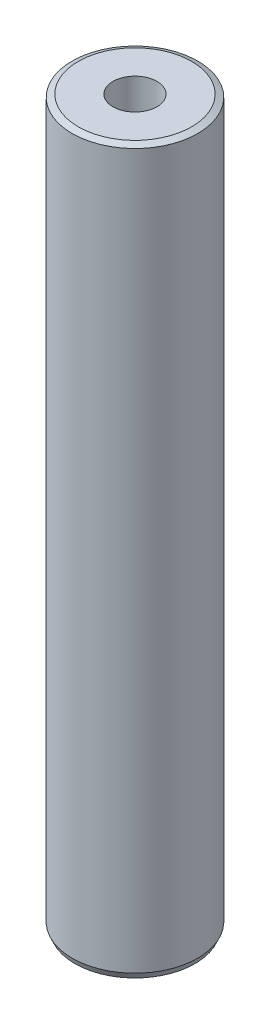
ISO-10303-21;
HEADER;
FILE_DESCRIPTION(('STEP AP214'),'2;1');
FILE_NAME('part.step','',(''),(''),'','','');
FILE_SCHEMA(('AUTOMOTIVE_DESIGN { 1 0 10303 214 1 1 1 1 }'));
ENDSEC;
DATA;
#1=APPLICATION_CONTEXT('core data for automotive mechanical design processes');
#2=APPLICATION_PROTOCOL_DEFINITION('international standard','automotive_design',2000,#1);
#3=PRODUCT_CONTEXT('',#1,'mechanical');
#4=PRODUCT('Part','Part','',(#3));
#5=PRODUCT_RELATED_PRODUCT_CATEGORY('part','',(#4));
#6=PRODUCT_DEFINITION_FORMATION('','',#4);
#7=PRODUCT_DEFINITION_CONTEXT('part definition',#1,'design');
#8=PRODUCT_DEFINITION('design','',#6,#7);
#9=PRODUCT_DEFINITION_SHAPE('','',#8);
#10=(LENGTH_UNIT() NAMED_UNIT(*) SI_UNIT(.MILLI.,.METRE.));
#11=(NAMED_UNIT(*) PLANE_ANGLE_UNIT() SI_UNIT($,.RADIAN.));
#12=(NAMED_UNIT(*) SI_UNIT($,.STERADIAN.) SOLID_ANGLE_UNIT());
#13=UNCERTAINTY_MEASURE_WITH_UNIT(LENGTH_MEASURE(1.E-05),#10,'distance_accuracy_value','');
#14=(GEOMETRIC_REPRESENTATION_CONTEXT(3) GLOBAL_UNCERTAINTY_ASSIGNED_CONTEXT((#13)) GLOBAL_UNIT_ASSIGNED_CONTEXT((#10,
#11,#12)) REPRESENTATION_CONTEXT('',''));
#15=CARTESIAN_POINT('',(0.,0.,0.));
#16=DIRECTION('',(0.,0.,1.));
#17=DIRECTION('',(1.,0.,0.));
#18=AXIS2_PLACEMENT_3D('',#15,#16,#17);
#19=CARTESIAN_POINT('',(0.,143.914848492371,0.));
#20=DIRECTION('',(0.,-1.,0.));
#21=DIRECTION('',(0.,0.,-1.));
#22=AXIS2_PLACEMENT_3D('',#19,#20,#21);
#23=CYLINDRICAL_SURFACE('',#22,12.5);
#24=CARTESIAN_POINT('',(0.,143.366414921944,0.));
#25=DIRECTION('',(0.,1.,0.));
#26=DIRECTION('',(0.,0.,1.));
#27=AXIS2_PLACEMENT_3D('',#24,#25,#26);
#28=CIRCLE('',#27,12.5);
#29=CARTESIAN_POINT('',(0.,143.366414921944,12.5));
#30=VERTEX_POINT('',#29);
#31=EDGE_CURVE('E50',#30,#30,#28,.F.);
#32=ORIENTED_EDGE('',*,*,#31,.T.);
#33=EDGE_LOOP('',(#32));
#34=FACE_BOUND('',#33,.T.);
#35=CARTESIAN_POINT('',(0.,1.21472858141486,0.));
#36=DIRECTION('',(0.,1.,0.));
#37=DIRECTION('',(0.,0.,1.));
#38=AXIS2_PLACEMENT_3D('',#35,#36,#37);
#39=CIRCLE('',#38,12.5);
#40=CARTESIAN_POINT('',(0.,1.21472858141486,12.5));
#41=VERTEX_POINT('',#40);
#42=EDGE_CURVE('E51',#41,#41,#39,.T.);
#43=ORIENTED_EDGE('',*,*,#42,.T.);
#44=EDGE_LOOP('',(#43));
#45=FACE_BOUND('',#44,.T.);
#46=ADVANCED_FACE('F39',(#34,#45),#23,.T.);
#47=CARTESIAN_POINT('',(0.,143.914848492371,0.));
#48=DIRECTION('',(0.,1.,0.));
#49=DIRECTION('',(0.,0.,1.));
#50=AXIS2_PLACEMENT_3D('',#47,#48,#49);
#51=PLANE('',#50);
#52=CARTESIAN_POINT('',(0.,143.914848492371,0.));
#53=DIRECTION('',(0.,1.,0.));
#54=DIRECTION('',(0.,0.,1.));
#55=AXIS2_PLACEMENT_3D('',#52,#53,#54);
#56=CIRCLE('',#55,11.2852714185852);
#57=CARTESIAN_POINT('',(0.,143.914848492371,11.2852714185852));
#58=VERTEX_POINT('',#57);
#59=EDGE_CURVE('E54',#58,#58,#56,.T.);
#60=ORIENTED_EDGE('',*,*,#59,.T.);
#61=EDGE_LOOP('',(#60));
#62=FACE_BOUND('',#61,.T.);
#63=CARTESIAN_POINT('',(0.,143.914848492371,0.));
#64=DIRECTION('',(0.,1.,0.));
#65=DIRECTION('',(0.,0.,1.));
#66=AXIS2_PLACEMENT_3D('',#63,#64,#65);
#67=CIRCLE('',#66,4.38202950056611);
#68=CARTESIAN_POINT('',(0.,143.914848492371,4.38202950056611));
#69=VERTEX_POINT('',#68);
#70=EDGE_CURVE('E58',#69,#69,#67,.T.);
#71=ORIENTED_EDGE('',*,*,#70,.F.);
#72=EDGE_LOOP('',(#71));
#73=FACE_BOUND('',#72,.T.);
#74=ADVANCED_FACE('F69',(#62,#73),#51,.T.);
#75=CARTESIAN_POINT('',(0.,0.,0.));
#76=DIRECTION('',(0.,1.,0.));
#77=DIRECTION('',(0.,0.,1.));
#78=AXIS2_PLACEMENT_3D('',#75,#76,#77);
#79=PLANE('',#78);
#80=CARTESIAN_POINT('',(0.,0.,0.));
#81=DIRECTION('',(0.,1.,0.));
#82=DIRECTION('',(0.,0.,1.));
#83=AXIS2_PLACEMENT_3D('',#80,#81,#82);
#84=CIRCLE('',#83,11.9515664295724);
#85=CARTESIAN_POINT('',(0.,0.,11.9515664295724));
#86=VERTEX_POINT('',#85);
#87=EDGE_CURVE('E10',#86,#86,#84,.F.);
#88=ORIENTED_EDGE('',*,*,#87,.T.);
#89=EDGE_LOOP('',(#88));
#90=FACE_BOUND('',#89,.T.);
#91=CARTESIAN_POINT('',(0.,0.,0.));
#92=DIRECTION('',(0.,1.,0.));
#93=DIRECTION('',(0.,0.,1.));
#94=AXIS2_PLACEMENT_3D('',#91,#92,#93);
#95=CIRCLE('',#94,4.38202950056611);
#96=CARTESIAN_POINT('',(0.,0.,4.38202950056611));
#97=VERTEX_POINT('',#96);
#98=EDGE_CURVE('E63',#97,#97,#95,.T.);
#99=ORIENTED_EDGE('',*,*,#98,.T.);
#100=EDGE_LOOP('',(#99));
#101=FACE_BOUND('',#100,.T.);
#102=ADVANCED_FACE('F75',(#90,#101),#79,.F.);
#103=CARTESIAN_POINT('',(0.,143.914848492371,0.));
#104=DIRECTION('',(0.,-1.,0.));
#105=DIRECTION('',(0.,0.,-1.));
#106=AXIS2_PLACEMENT_3D('',#103,#104,#105);
#107=CYLINDRICAL_SURFACE('',#106,4.38202950056611);
#108=ORIENTED_EDGE('',*,*,#70,.T.);
#109=EDGE_LOOP('',(#108));
#110=FACE_BOUND('',#109,.T.);
#111=ORIENTED_EDGE('',*,*,#98,.F.);
#112=EDGE_LOOP('',(#111));
#113=FACE_BOUND('',#112,.T.);
#114=ADVANCED_FACE('F70',(#110,#113),#107,.F.);
#115=CARTESIAN_POINT('',(0.,143.914848492371,0.));
#116=DIRECTION('',(0.,-1.,0.));
#117=DIRECTION('',(0.,0.,-1.));
#118=AXIS2_PLACEMENT_3D('',#115,#116,#117);
#119=CONICAL_SURFACE('',#118,11.2852714185852,1.14670690383982);
#120=ORIENTED_EDGE('',*,*,#31,.F.);
#121=EDGE_LOOP('',(#120));
#122=FACE_BOUND('',#121,.T.);
#123=ORIENTED_EDGE('',*,*,#59,.F.);
#124=EDGE_LOOP('',(#123));
#125=FACE_BOUND('',#124,.T.);
#126=ADVANCED_FACE('F81',(#122,#125),#119,.T.);
#127=CARTESIAN_POINT('',(0.,1.21472858141486,0.));
#128=DIRECTION('',(0.,1.,0.));
#129=DIRECTION('',(0.,0.,1.));
#130=AXIS2_PLACEMENT_3D('',#127,#128,#129);
#131=CONICAL_SURFACE('',#130,12.5,0.424089422955088);
#132=ORIENTED_EDGE('',*,*,#87,.F.);
#133=EDGE_LOOP('',(#132));
#134=FACE_BOUND('',#133,.T.);
#135=ORIENTED_EDGE('',*,*,#42,.F.);
#136=EDGE_LOOP('',(#135));
#137=FACE_BOUND('',#136,.T.);
#138=ADVANCED_FACE('F45',(#134,#137),#131,.T.);
#139=CLOSED_SHELL('',(#46,#74,#102,#114,#126,#138));
#140=MANIFOLD_SOLID_BREP('B2',#139);
#141=ADVANCED_BREP_SHAPE_REPRESENTATION('',(#18,#140),#14);
#142=SHAPE_DEFINITION_REPRESENTATION(#9,#141);
ENDSEC;
END-ISO-10303-21;
